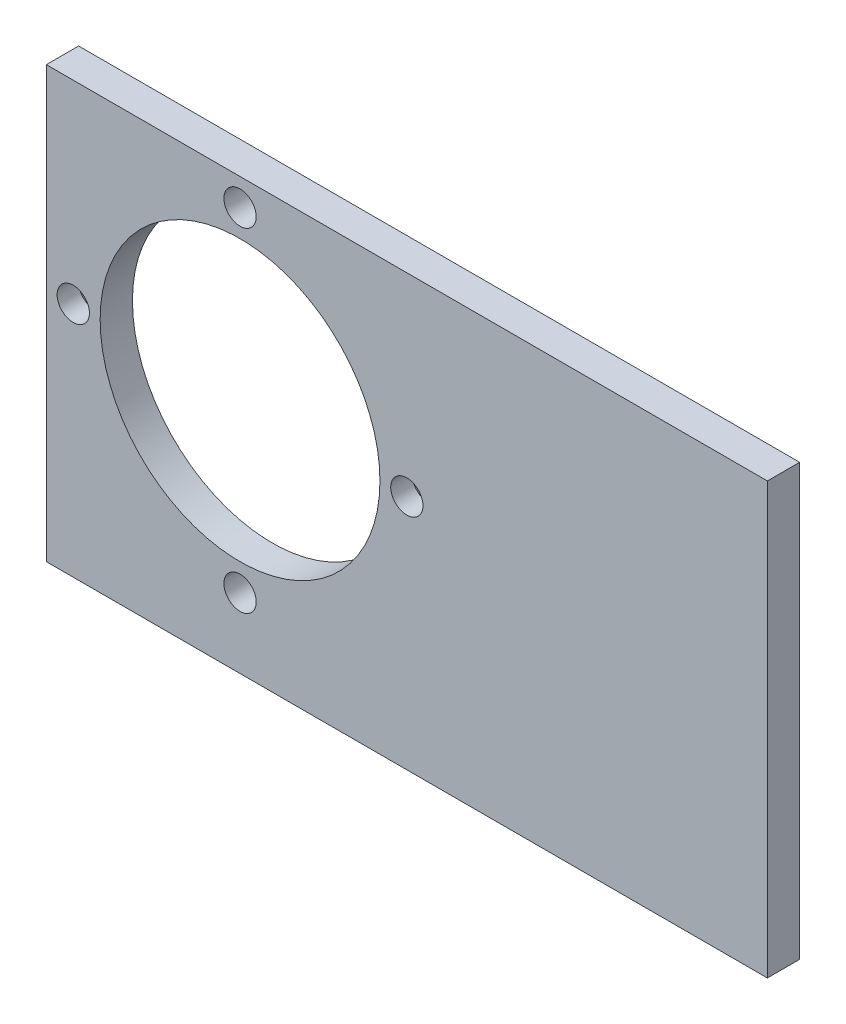
ISO-10303-21;
HEADER;
FILE_DESCRIPTION(('STEP AP214'),'2;1');
FILE_NAME('part.step','',(''),(''),'','','');
FILE_SCHEMA(('AUTOMOTIVE_DESIGN { 1 0 10303 214 1 1 1 1 }'));
ENDSEC;
DATA;
#1=APPLICATION_CONTEXT('core data for automotive mechanical design processes');
#2=APPLICATION_PROTOCOL_DEFINITION('international standard','automotive_design',2000,#1);
#3=PRODUCT_CONTEXT('',#1,'mechanical');
#4=PRODUCT('Part','Part','',(#3));
#5=PRODUCT_RELATED_PRODUCT_CATEGORY('part','',(#4));
#6=PRODUCT_DEFINITION_FORMATION('','',#4);
#7=PRODUCT_DEFINITION_CONTEXT('part definition',#1,'design');
#8=PRODUCT_DEFINITION('design','',#6,#7);
#9=PRODUCT_DEFINITION_SHAPE('','',#8);
#10=(LENGTH_UNIT() NAMED_UNIT(*) SI_UNIT(.MILLI.,.METRE.));
#11=(NAMED_UNIT(*) PLANE_ANGLE_UNIT() SI_UNIT($,.RADIAN.));
#12=(NAMED_UNIT(*) SI_UNIT($,.STERADIAN.) SOLID_ANGLE_UNIT());
#13=UNCERTAINTY_MEASURE_WITH_UNIT(LENGTH_MEASURE(1.E-05),#10,'distance_accuracy_value','');
#14=(GEOMETRIC_REPRESENTATION_CONTEXT(3) GLOBAL_UNCERTAINTY_ASSIGNED_CONTEXT((#13)) GLOBAL_UNIT_ASSIGNED_CONTEXT((#10,
#11,#12)) REPRESENTATION_CONTEXT('',''));
#15=CARTESIAN_POINT('',(0.,0.,0.));
#16=DIRECTION('',(0.,0.,1.));
#17=DIRECTION('',(1.,0.,0.));
#18=AXIS2_PLACEMENT_3D('',#15,#16,#17);
#19=CARTESIAN_POINT('',(0.,0.,3.));
#20=DIRECTION('',(0.,0.,1.));
#21=DIRECTION('',(1.,0.,0.));
#22=AXIS2_PLACEMENT_3D('',#19,#20,#21);
#23=PLANE('',#22);
#24=CARTESIAN_POINT('',(70.4,129.33,3.));
#25=DIRECTION('',(0.,0.,1.));
#26=DIRECTION('',(1.,0.,0.));
#27=AXIS2_PLACEMENT_3D('',#24,#25,#26);
#28=CIRCLE('',#27,1.50000000000001);
#29=CARTESIAN_POINT('',(71.9,129.33,3.));
#30=VERTEX_POINT('',#29);
#31=EDGE_CURVE('E172',#30,#30,#28,.T.);
#32=ORIENTED_EDGE('',*,*,#31,.F.);
#33=EDGE_LOOP('',(#32));
#34=FACE_BOUND('',#33,.T.);
#35=CARTESIAN_POINT('',(39.4,129.33,3.));
#36=DIRECTION('',(0.,0.,1.));
#37=DIRECTION('',(1.,0.,0.));
#38=AXIS2_PLACEMENT_3D('',#35,#36,#37);
#39=CIRCLE('',#38,1.5);
#40=CARTESIAN_POINT('',(40.9,129.33,3.));
#41=VERTEX_POINT('',#40);
#42=EDGE_CURVE('E165',#41,#41,#39,.T.);
#43=ORIENTED_EDGE('',*,*,#42,.F.);
#44=EDGE_LOOP('',(#43));
#45=FACE_BOUND('',#44,.T.);
#46=DIRECTION('',(0.,-1.,0.));
#47=VECTOR('',#46,1.);
#48=CARTESIAN_POINT('',(36.9,147.33,3.));
#49=LINE('',#48,#47);
#50=CARTESIAN_POINT('',(36.9,147.33,3.));
#51=VERTEX_POINT('',#50);
#52=CARTESIAN_POINT('',(36.9,107.33,3.));
#53=VERTEX_POINT('',#52);
#54=EDGE_CURVE('E99',#51,#53,#49,.T.);
#55=ORIENTED_EDGE('',*,*,#54,.T.);
#56=DIRECTION('',(1.,0.,0.));
#57=VECTOR('',#56,1.);
#58=CARTESIAN_POINT('',(36.9,107.33,3.));
#59=LINE('',#58,#57);
#60=CARTESIAN_POINT('',(103.9,107.33,3.));
#61=VERTEX_POINT('',#60);
#62=EDGE_CURVE('E89',#53,#61,#59,.T.);
#63=ORIENTED_EDGE('',*,*,#62,.T.);
#64=DIRECTION('',(0.,1.,0.));
#65=VECTOR('',#64,1.);
#66=CARTESIAN_POINT('',(103.9,147.33,3.));
#67=LINE('',#66,#65);
#68=CARTESIAN_POINT('',(103.9,147.33,3.));
#69=VERTEX_POINT('',#68);
#70=EDGE_CURVE('E98',#61,#69,#67,.T.);
#71=ORIENTED_EDGE('',*,*,#70,.T.);
#72=DIRECTION('',(-1.,0.,0.));
#73=VECTOR('',#72,1.);
#74=CARTESIAN_POINT('',(36.9,147.33,3.));
#75=LINE('',#74,#73);
#76=EDGE_CURVE('E104',#69,#51,#75,.T.);
#77=ORIENTED_EDGE('',*,*,#76,.T.);
#78=EDGE_LOOP('',(#55,#63,#71,#77));
#79=FACE_BOUND('',#78,.T.);
#80=CARTESIAN_POINT('',(54.9,129.33,3.));
#81=DIRECTION('',(0.,0.,1.));
#82=DIRECTION('',(1.,0.,0.));
#83=AXIS2_PLACEMENT_3D('',#80,#81,#82);
#84=CIRCLE('',#83,13.);
#85=CARTESIAN_POINT('',(67.9,129.33,3.));
#86=VERTEX_POINT('',#85);
#87=EDGE_CURVE('E144',#86,#86,#84,.T.);
#88=ORIENTED_EDGE('',*,*,#87,.F.);
#89=EDGE_LOOP('',(#88));
#90=FACE_BOUND('',#89,.T.);
#91=CARTESIAN_POINT('',(54.9,144.83,3.));
#92=DIRECTION('',(0.,0.,1.));
#93=DIRECTION('',(1.,0.,0.));
#94=AXIS2_PLACEMENT_3D('',#91,#92,#93);
#95=CIRCLE('',#94,1.50000000000002);
#96=CARTESIAN_POINT('',(56.4,144.83,3.));
#97=VERTEX_POINT('',#96);
#98=EDGE_CURVE('E168',#97,#97,#95,.T.);
#99=ORIENTED_EDGE('',*,*,#98,.F.);
#100=EDGE_LOOP('',(#99));
#101=FACE_BOUND('',#100,.T.);
#102=CARTESIAN_POINT('',(54.9,113.83,3.));
#103=DIRECTION('',(0.,0.,1.));
#104=DIRECTION('',(1.,0.,0.));
#105=AXIS2_PLACEMENT_3D('',#102,#103,#104);
#106=CIRCLE('',#105,1.50000000000004);
#107=CARTESIAN_POINT('',(56.4000000000001,113.83,3.));
#108=VERTEX_POINT('',#107);
#109=EDGE_CURVE('E177',#108,#108,#106,.T.);
#110=ORIENTED_EDGE('',*,*,#109,.F.);
#111=EDGE_LOOP('',(#110));
#112=FACE_BOUND('',#111,.T.);
#113=ADVANCED_FACE('F38',(#34,#45,#79,#90,#101,#112),#23,.T.);
#114=CARTESIAN_POINT('',(0.,0.,0.));
#115=DIRECTION('',(0.,0.,1.));
#116=DIRECTION('',(1.,0.,0.));
#117=AXIS2_PLACEMENT_3D('',#114,#115,#116);
#118=PLANE('',#117);
#119=CARTESIAN_POINT('',(54.9,129.33,0.));
#120=DIRECTION('',(0.,0.,1.));
#121=DIRECTION('',(1.,0.,0.));
#122=AXIS2_PLACEMENT_3D('',#119,#120,#121);
#123=CIRCLE('',#122,13.);
#124=CARTESIAN_POINT('',(67.9,129.33,0.));
#125=VERTEX_POINT('',#124);
#126=CARTESIAN_POINT('',(41.9,129.33,0.));
#127=VERTEX_POINT('',#126);
#128=EDGE_CURVE('E141',#125,#127,#123,.T.);
#129=ORIENTED_EDGE('',*,*,#128,.T.);
#130=CARTESIAN_POINT('',(39.4,129.33,0.));
#131=DIRECTION('',(0.,0.,1.));
#132=DIRECTION('',(1.,0.,0.));
#133=AXIS2_PLACEMENT_3D('',#130,#131,#132);
#134=CIRCLE('',#133,2.50000000000001);
#135=CARTESIAN_POINT('',(36.9,129.33,0.));
#136=VERTEX_POINT('',#135);
#137=EDGE_CURVE('E121',#127,#136,#134,.T.);
#138=ORIENTED_EDGE('',*,*,#137,.T.);
#139=DIRECTION('',(0.,-1.,0.));
#140=VECTOR('',#139,1.);
#141=CARTESIAN_POINT('',(36.9,147.33,0.));
#142=LINE('',#141,#140);
#143=CARTESIAN_POINT('',(36.9,147.33,0.));
#144=VERTEX_POINT('',#143);
#145=EDGE_CURVE('E139',#144,#136,#142,.T.);
#146=ORIENTED_EDGE('',*,*,#145,.F.);
#147=DIRECTION('',(-1.,0.,0.));
#148=VECTOR('',#147,1.);
#149=CARTESIAN_POINT('',(36.9,147.33,0.));
#150=LINE('',#149,#148);
#151=CARTESIAN_POINT('',(103.9,147.33,0.));
#152=VERTEX_POINT('',#151);
#153=EDGE_CURVE('E108',#152,#144,#150,.T.);
#154=ORIENTED_EDGE('',*,*,#153,.F.);
#155=DIRECTION('',(0.,1.,0.));
#156=VECTOR('',#155,1.);
#157=CARTESIAN_POINT('',(103.9,147.33,0.));
#158=LINE('',#157,#156);
#159=CARTESIAN_POINT('',(103.9,107.33,0.));
#160=VERTEX_POINT('',#159);
#161=EDGE_CURVE('E147',#160,#152,#158,.T.);
#162=ORIENTED_EDGE('',*,*,#161,.F.);
#163=DIRECTION('',(1.,0.,0.));
#164=VECTOR('',#163,1.);
#165=CARTESIAN_POINT('',(36.9,107.33,0.));
#166=LINE('',#165,#164);
#167=CARTESIAN_POINT('',(36.9,107.33,0.));
#168=VERTEX_POINT('',#167);
#169=EDGE_CURVE('E143',#168,#160,#166,.T.);
#170=ORIENTED_EDGE('',*,*,#169,.F.);
#171=EDGE_CURVE('E112',#136,#168,#142,.T.);
#172=ORIENTED_EDGE('',*,*,#171,.F.);
#173=CARTESIAN_POINT('',(39.4,129.33,0.));
#174=DIRECTION('',(0.,0.,1.));
#175=DIRECTION('',(1.,0.,0.));
#176=AXIS2_PLACEMENT_3D('',#173,#174,#175);
#177=CIRCLE('',#176,2.50000000000001);
#178=EDGE_CURVE('E54',#136,#127,#177,.T.);
#179=ORIENTED_EDGE('',*,*,#178,.T.);
#180=EDGE_CURVE('E162',#127,#125,#123,.T.);
#181=ORIENTED_EDGE('',*,*,#180,.T.);
#182=CARTESIAN_POINT('',(70.4,129.33,0.));
#183=DIRECTION('',(0.,0.,1.));
#184=DIRECTION('',(1.,0.,0.));
#185=AXIS2_PLACEMENT_3D('',#182,#183,#184);
#186=CIRCLE('',#185,2.5);
#187=EDGE_CURVE('E60',#125,#125,#186,.T.);
#188=ORIENTED_EDGE('',*,*,#187,.T.);
#189=EDGE_LOOP('',(#129,#138,#146,#154,#162,#170,#172,#179,#181,#188));
#190=FACE_BOUND('',#189,.T.);
#191=CARTESIAN_POINT('',(54.9,144.83,0.));
#192=DIRECTION('',(0.,0.,1.));
#193=DIRECTION('',(1.,0.,0.));
#194=AXIS2_PLACEMENT_3D('',#191,#192,#193);
#195=CIRCLE('',#194,1.50000000000002);
#196=CARTESIAN_POINT('',(56.4,144.83,0.));
#197=VERTEX_POINT('',#196);
#198=EDGE_CURVE('E169',#197,#197,#195,.T.);
#199=ORIENTED_EDGE('',*,*,#198,.T.);
#200=EDGE_LOOP('',(#199));
#201=FACE_BOUND('',#200,.T.);
#202=CARTESIAN_POINT('',(54.9,113.83,0.));
#203=DIRECTION('',(0.,0.,1.));
#204=DIRECTION('',(1.,0.,0.));
#205=AXIS2_PLACEMENT_3D('',#202,#203,#204);
#206=CIRCLE('',#205,1.50000000000004);
#207=CARTESIAN_POINT('',(56.4000000000001,113.83,0.));
#208=VERTEX_POINT('',#207);
#209=EDGE_CURVE('E178',#208,#208,#206,.T.);
#210=ORIENTED_EDGE('',*,*,#209,.T.);
#211=EDGE_LOOP('',(#210));
#212=FACE_BOUND('',#211,.T.);
#213=ADVANCED_FACE('F136',(#190,#201,#212),#118,.F.);
#214=CARTESIAN_POINT('',(36.9,147.33,3.));
#215=DIRECTION('',(1.,0.,0.));
#216=DIRECTION('',(0.,1.,0.));
#217=AXIS2_PLACEMENT_3D('',#214,#215,#216);
#218=PLANE('',#217);
#219=ORIENTED_EDGE('',*,*,#145,.T.);
#220=ORIENTED_EDGE('',*,*,#171,.T.);
#221=DIRECTION('',(0.,0.,-1.));
#222=VECTOR('',#221,1.);
#223=CARTESIAN_POINT('',(36.9,107.33,3.));
#224=LINE('',#223,#222);
#225=EDGE_CURVE('E93',#53,#168,#224,.T.);
#226=ORIENTED_EDGE('',*,*,#225,.F.);
#227=ORIENTED_EDGE('',*,*,#54,.F.);
#228=DIRECTION('',(0.,0.,-1.));
#229=VECTOR('',#228,1.);
#230=CARTESIAN_POINT('',(36.9,147.33,3.));
#231=LINE('',#230,#229);
#232=EDGE_CURVE('E146',#51,#144,#231,.T.);
#233=ORIENTED_EDGE('',*,*,#232,.T.);
#234=EDGE_LOOP('',(#219,#220,#226,#227,#233));
#235=FACE_BOUND('',#234,.T.);
#236=ADVANCED_FACE('F111',(#235),#218,.F.);
#237=CARTESIAN_POINT('',(36.9,107.33,3.));
#238=DIRECTION('',(0.,1.,0.));
#239=DIRECTION('',(-1.,0.,0.));
#240=AXIS2_PLACEMENT_3D('',#237,#238,#239);
#241=PLANE('',#240);
#242=ORIENTED_EDGE('',*,*,#169,.T.);
#243=DIRECTION('',(0.,0.,-1.));
#244=VECTOR('',#243,1.);
#245=CARTESIAN_POINT('',(103.9,107.33,3.));
#246=LINE('',#245,#244);
#247=EDGE_CURVE('E95',#61,#160,#246,.T.);
#248=ORIENTED_EDGE('',*,*,#247,.F.);
#249=ORIENTED_EDGE('',*,*,#62,.F.);
#250=ORIENTED_EDGE('',*,*,#225,.T.);
#251=EDGE_LOOP('',(#242,#248,#249,#250));
#252=FACE_BOUND('',#251,.T.);
#253=ADVANCED_FACE('F91',(#252),#241,.F.);
#254=CARTESIAN_POINT('',(103.9,147.33,3.));
#255=DIRECTION('',(-1.,0.,0.));
#256=DIRECTION('',(0.,0.,1.));
#257=AXIS2_PLACEMENT_3D('',#254,#255,#256);
#258=PLANE('',#257);
#259=ORIENTED_EDGE('',*,*,#161,.T.);
#260=DIRECTION('',(0.,0.,-1.));
#261=VECTOR('',#260,1.);
#262=CARTESIAN_POINT('',(103.9,147.33,3.));
#263=LINE('',#262,#261);
#264=EDGE_CURVE('E116',#69,#152,#263,.T.);
#265=ORIENTED_EDGE('',*,*,#264,.F.);
#266=ORIENTED_EDGE('',*,*,#70,.F.);
#267=ORIENTED_EDGE('',*,*,#247,.T.);
#268=EDGE_LOOP('',(#259,#265,#266,#267));
#269=FACE_BOUND('',#268,.T.);
#270=ADVANCED_FACE('F159',(#269),#258,.F.);
#271=CARTESIAN_POINT('',(36.9,147.33,3.));
#272=DIRECTION('',(0.,-1.,0.));
#273=DIRECTION('',(1.,0.,0.));
#274=AXIS2_PLACEMENT_3D('',#271,#272,#273);
#275=PLANE('',#274);
#276=ORIENTED_EDGE('',*,*,#153,.T.);
#277=ORIENTED_EDGE('',*,*,#232,.F.);
#278=ORIENTED_EDGE('',*,*,#76,.F.);
#279=ORIENTED_EDGE('',*,*,#264,.T.);
#280=EDGE_LOOP('',(#276,#277,#278,#279));
#281=FACE_BOUND('',#280,.T.);
#282=ADVANCED_FACE('F157',(#281),#275,.F.);
#283=CARTESIAN_POINT('',(54.9,129.33,3.));
#284=DIRECTION('',(0.,0.,-1.));
#285=DIRECTION('',(-1.,0.,0.));
#286=AXIS2_PLACEMENT_3D('',#283,#284,#285);
#287=CYLINDRICAL_SURFACE('',#286,13.);
#288=ORIENTED_EDGE('',*,*,#87,.T.);
#289=EDGE_LOOP('',(#288));
#290=FACE_BOUND('',#289,.T.);
#291=ORIENTED_EDGE('',*,*,#128,.F.);
#292=ORIENTED_EDGE('',*,*,#180,.F.);
#293=EDGE_LOOP('',(#291,#292));
#294=FACE_BOUND('',#293,.T.);
#295=ADVANCED_FACE('F196',(#290,#294),#287,.F.);
#296=CARTESIAN_POINT('',(39.4,129.33,3.));
#297=DIRECTION('',(0.,0.,-1.));
#298=DIRECTION('',(-1.,0.,0.));
#299=AXIS2_PLACEMENT_3D('',#296,#297,#298);
#300=CYLINDRICAL_SURFACE('',#299,1.5);
#301=CARTESIAN_POINT('',(39.4,129.33,1.00000000000002));
#302=DIRECTION('',(0.,0.,1.));
#303=DIRECTION('',(1.,0.,0.));
#304=AXIS2_PLACEMENT_3D('',#301,#302,#303);
#305=CIRCLE('',#304,1.5);
#306=CARTESIAN_POINT('',(40.9,129.33,1.00000000000002));
#307=VERTEX_POINT('',#306);
#308=EDGE_CURVE('E47',#307,#307,#305,.F.);
#309=ORIENTED_EDGE('',*,*,#308,.T.);
#310=EDGE_LOOP('',(#309));
#311=FACE_BOUND('',#310,.T.);
#312=ORIENTED_EDGE('',*,*,#42,.T.);
#313=EDGE_LOOP('',(#312));
#314=FACE_BOUND('',#313,.T.);
#315=ADVANCED_FACE('F126',(#311,#314),#300,.F.);
#316=CARTESIAN_POINT('',(54.9,144.83,3.));
#317=DIRECTION('',(0.,0.,-1.));
#318=DIRECTION('',(-1.,0.,0.));
#319=AXIS2_PLACEMENT_3D('',#316,#317,#318);
#320=CYLINDRICAL_SURFACE('',#319,1.50000000000002);
#321=ORIENTED_EDGE('',*,*,#98,.T.);
#322=EDGE_LOOP('',(#321));
#323=FACE_BOUND('',#322,.T.);
#324=ORIENTED_EDGE('',*,*,#198,.F.);
#325=EDGE_LOOP('',(#324));
#326=FACE_BOUND('',#325,.T.);
#327=ADVANCED_FACE('F240',(#323,#326),#320,.F.);
#328=CARTESIAN_POINT('',(70.4,129.33,3.));
#329=DIRECTION('',(0.,0.,-1.));
#330=DIRECTION('',(-1.,0.,0.));
#331=AXIS2_PLACEMENT_3D('',#328,#329,#330);
#332=CYLINDRICAL_SURFACE('',#331,1.50000000000001);
#333=CARTESIAN_POINT('',(70.4,129.33,0.99999999999999));
#334=DIRECTION('',(0.,0.,1.));
#335=DIRECTION('',(1.,0.,0.));
#336=AXIS2_PLACEMENT_3D('',#333,#334,#335);
#337=CIRCLE('',#336,1.50000000000001);
#338=CARTESIAN_POINT('',(71.9,129.33,0.99999999999999));
#339=VERTEX_POINT('',#338);
#340=EDGE_CURVE('E11',#339,#339,#337,.F.);
#341=ORIENTED_EDGE('',*,*,#340,.T.);
#342=EDGE_LOOP('',(#341));
#343=FACE_BOUND('',#342,.T.);
#344=ORIENTED_EDGE('',*,*,#31,.T.);
#345=EDGE_LOOP('',(#344));
#346=FACE_BOUND('',#345,.T.);
#347=ADVANCED_FACE('F246',(#343,#346),#332,.F.);
#348=CARTESIAN_POINT('',(54.9,113.83,3.));
#349=DIRECTION('',(0.,0.,-1.));
#350=DIRECTION('',(-1.,0.,0.));
#351=AXIS2_PLACEMENT_3D('',#348,#349,#350);
#352=CYLINDRICAL_SURFACE('',#351,1.50000000000004);
#353=ORIENTED_EDGE('',*,*,#109,.T.);
#354=EDGE_LOOP('',(#353));
#355=FACE_BOUND('',#354,.T.);
#356=ORIENTED_EDGE('',*,*,#209,.F.);
#357=EDGE_LOOP('',(#356));
#358=FACE_BOUND('',#357,.T.);
#359=ADVANCED_FACE('F132',(#355,#358),#352,.F.);
#360=CARTESIAN_POINT('',(39.4,129.33,0.));
#361=DIRECTION('',(0.,0.,-1.));
#362=DIRECTION('',(-1.,0.,0.));
#363=AXIS2_PLACEMENT_3D('',#360,#361,#362);
#364=CONICAL_SURFACE('',#363,2.50000000000001,0.785398163397442);
#365=ORIENTED_EDGE('',*,*,#308,.F.);
#366=EDGE_LOOP('',(#365));
#367=FACE_BOUND('',#366,.T.);
#368=ORIENTED_EDGE('',*,*,#178,.F.);
#369=ORIENTED_EDGE('',*,*,#137,.F.);
#370=EDGE_LOOP('',(#368,#369));
#371=FACE_BOUND('',#370,.T.);
#372=ADVANCED_FACE('F129',(#367,#371),#364,.F.);
#373=CARTESIAN_POINT('',(70.4,129.33,0.));
#374=DIRECTION('',(0.,0.,-1.));
#375=DIRECTION('',(-1.,0.,0.));
#376=AXIS2_PLACEMENT_3D('',#373,#374,#375);
#377=CONICAL_SURFACE('',#376,2.5,0.785398163397449);
#378=ORIENTED_EDGE('',*,*,#340,.F.);
#379=EDGE_LOOP('',(#378));
#380=FACE_BOUND('',#379,.T.);
#381=ORIENTED_EDGE('',*,*,#187,.F.);
#382=EDGE_LOOP('',(#381));
#383=FACE_BOUND('',#382,.T.);
#384=ADVANCED_FACE('F41',(#380,#383),#377,.F.);
#385=CLOSED_SHELL('',(#113,#213,#236,#253,#270,#282,#295,#315,#327,#347,#359,#372,#384));
#386=MANIFOLD_SOLID_BREP('B2',#385);
#387=ADVANCED_BREP_SHAPE_REPRESENTATION('',(#18,#386),#14);
#388=SHAPE_DEFINITION_REPRESENTATION(#9,#387);
ENDSEC;
END-ISO-10303-21;
